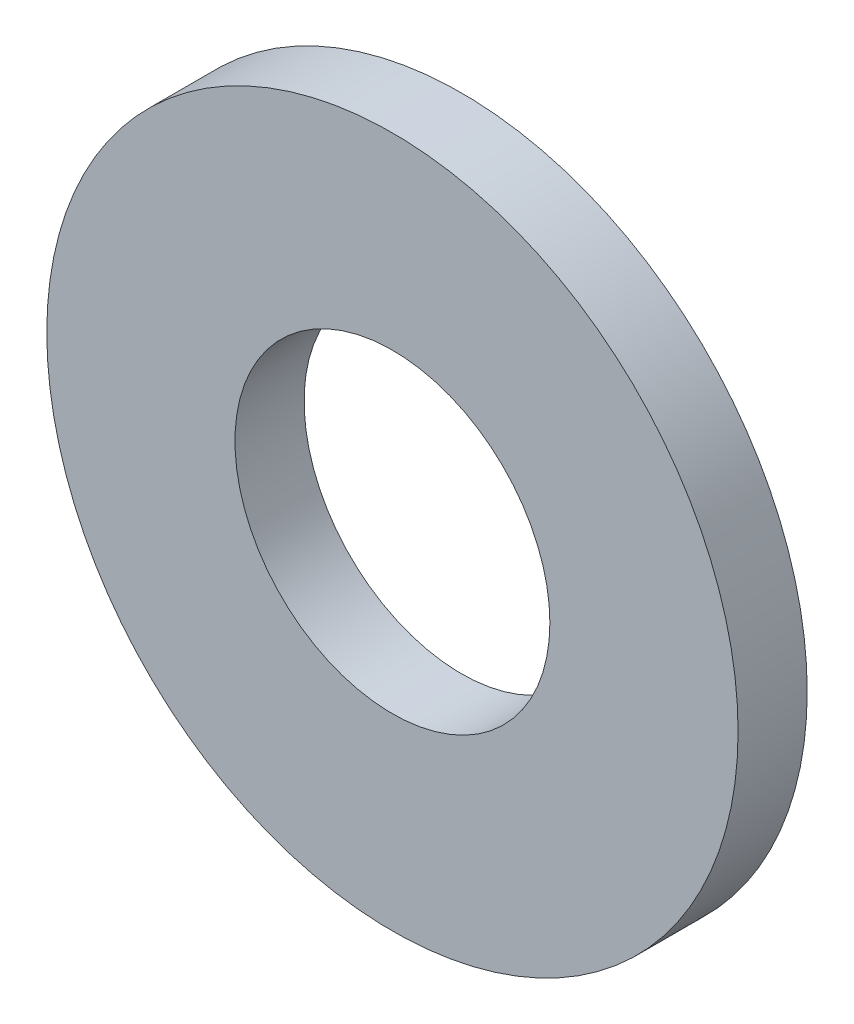
ISO-10303-21;
HEADER;
FILE_DESCRIPTION(('STEP AP214'),'2;1');
FILE_NAME('part.step','',(''),(''),'','','');
FILE_SCHEMA(('AUTOMOTIVE_DESIGN { 1 0 10303 214 1 1 1 1 }'));
ENDSEC;
DATA;
#1=APPLICATION_CONTEXT('core data for automotive mechanical design processes');
#2=APPLICATION_PROTOCOL_DEFINITION('international standard','automotive_design',2000,#1);
#3=PRODUCT_CONTEXT('',#1,'mechanical');
#4=PRODUCT('Part','Part','',(#3));
#5=PRODUCT_RELATED_PRODUCT_CATEGORY('part','',(#4));
#6=PRODUCT_DEFINITION_FORMATION('','',#4);
#7=PRODUCT_DEFINITION_CONTEXT('part definition',#1,'design');
#8=PRODUCT_DEFINITION('design','',#6,#7);
#9=PRODUCT_DEFINITION_SHAPE('','',#8);
#10=(LENGTH_UNIT() NAMED_UNIT(*) SI_UNIT(.MILLI.,.METRE.));
#11=(NAMED_UNIT(*) PLANE_ANGLE_UNIT() SI_UNIT($,.RADIAN.));
#12=(NAMED_UNIT(*) SI_UNIT($,.STERADIAN.) SOLID_ANGLE_UNIT());
#13=UNCERTAINTY_MEASURE_WITH_UNIT(LENGTH_MEASURE(1.E-05),#10,'distance_accuracy_value','');
#14=(GEOMETRIC_REPRESENTATION_CONTEXT(3) GLOBAL_UNCERTAINTY_ASSIGNED_CONTEXT((#13)) GLOBAL_UNIT_ASSIGNED_CONTEXT((#10,
#11,#12)) REPRESENTATION_CONTEXT('',''));
#15=CARTESIAN_POINT('',(0.,0.,0.));
#16=DIRECTION('',(0.,0.,1.));
#17=DIRECTION('',(1.,0.,0.));
#18=AXIS2_PLACEMENT_3D('',#15,#16,#17);
#19=CARTESIAN_POINT('',(0.,0.,0.9));
#20=DIRECTION('',(0.,0.,1.));
#21=DIRECTION('',(1.,0.,0.));
#22=AXIS2_PLACEMENT_3D('',#19,#20,#21);
#23=PLANE('',#22);
#24=CARTESIAN_POINT('',(0.,0.,0.9));
#25=DIRECTION('',(0.,0.,1.));
#26=DIRECTION('',(1.,0.,0.));
#27=AXIS2_PLACEMENT_3D('',#24,#25,#26);
#28=CIRCLE('',#27,4.5);
#29=CARTESIAN_POINT('',(4.5,0.,0.9));
#30=VERTEX_POINT('',#29);
#31=EDGE_CURVE('E10',#30,#30,#28,.T.);
#32=ORIENTED_EDGE('',*,*,#31,.T.);
#33=EDGE_LOOP('',(#32));
#34=FACE_BOUND('',#33,.T.);
#35=CARTESIAN_POINT('',(0.,0.,0.9));
#36=DIRECTION('',(0.,0.,1.));
#37=DIRECTION('',(1.,0.,0.));
#38=AXIS2_PLACEMENT_3D('',#35,#36,#37);
#39=CIRCLE('',#38,2.05);
#40=CARTESIAN_POINT('',(2.05,0.,0.9));
#41=VERTEX_POINT('',#40);
#42=EDGE_CURVE('E42',#41,#41,#39,.T.);
#43=ORIENTED_EDGE('',*,*,#42,.F.);
#44=EDGE_LOOP('',(#43));
#45=FACE_BOUND('',#44,.T.);
#46=ADVANCED_FACE('F31',(#34,#45),#23,.T.);
#47=CARTESIAN_POINT('',(0.,0.,0.));
#48=DIRECTION('',(0.,0.,1.));
#49=DIRECTION('',(1.,0.,0.));
#50=AXIS2_PLACEMENT_3D('',#47,#48,#49);
#51=PLANE('',#50);
#52=CARTESIAN_POINT('',(0.,0.,0.));
#53=DIRECTION('',(0.,0.,1.));
#54=DIRECTION('',(1.,0.,0.));
#55=AXIS2_PLACEMENT_3D('',#52,#53,#54);
#56=CIRCLE('',#55,4.5);
#57=CARTESIAN_POINT('',(4.5,0.,0.));
#58=VERTEX_POINT('',#57);
#59=EDGE_CURVE('E35',#58,#58,#56,.T.);
#60=ORIENTED_EDGE('',*,*,#59,.F.);
#61=EDGE_LOOP('',(#60));
#62=FACE_BOUND('',#61,.T.);
#63=CARTESIAN_POINT('',(0.,0.,0.));
#64=DIRECTION('',(0.,0.,1.));
#65=DIRECTION('',(1.,0.,0.));
#66=AXIS2_PLACEMENT_3D('',#63,#64,#65);
#67=CIRCLE('',#66,2.05);
#68=CARTESIAN_POINT('',(2.05,0.,0.));
#69=VERTEX_POINT('',#68);
#70=EDGE_CURVE('E44',#69,#69,#67,.T.);
#71=ORIENTED_EDGE('',*,*,#70,.T.);
#72=EDGE_LOOP('',(#71));
#73=FACE_BOUND('',#72,.T.);
#74=ADVANCED_FACE('F54',(#62,#73),#51,.F.);
#75=CARTESIAN_POINT('',(0.,0.,0.9));
#76=DIRECTION('',(0.,0.,-1.));
#77=DIRECTION('',(-1.,0.,0.));
#78=AXIS2_PLACEMENT_3D('',#75,#76,#77);
#79=CYLINDRICAL_SURFACE('',#78,4.5);
#80=ORIENTED_EDGE('',*,*,#31,.F.);
#81=EDGE_LOOP('',(#80));
#82=FACE_BOUND('',#81,.T.);
#83=ORIENTED_EDGE('',*,*,#59,.T.);
#84=EDGE_LOOP('',(#83));
#85=FACE_BOUND('',#84,.T.);
#86=ADVANCED_FACE('F33',(#82,#85),#79,.T.);
#87=CARTESIAN_POINT('',(0.,0.,0.9));
#88=DIRECTION('',(0.,0.,-1.));
#89=DIRECTION('',(-1.,0.,0.));
#90=AXIS2_PLACEMENT_3D('',#87,#88,#89);
#91=CYLINDRICAL_SURFACE('',#90,2.05);
#92=ORIENTED_EDGE('',*,*,#42,.T.);
#93=EDGE_LOOP('',(#92));
#94=FACE_BOUND('',#93,.T.);
#95=ORIENTED_EDGE('',*,*,#70,.F.);
#96=EDGE_LOOP('',(#95));
#97=FACE_BOUND('',#96,.T.);
#98=ADVANCED_FACE('F50',(#94,#97),#91,.F.);
#99=CLOSED_SHELL('',(#46,#74,#86,#98));
#100=MANIFOLD_SOLID_BREP('B2',#99);
#101=ADVANCED_BREP_SHAPE_REPRESENTATION('',(#18,#100),#14);
#102=SHAPE_DEFINITION_REPRESENTATION(#9,#101);
ENDSEC;
END-ISO-10303-21;
